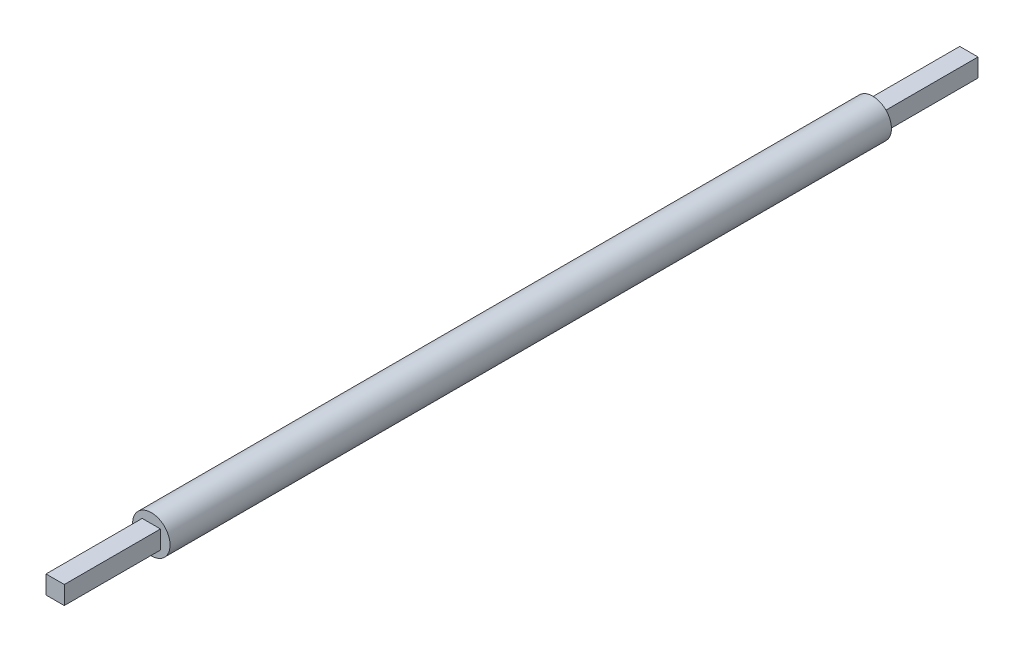
ISO-10303-21;
HEADER;
FILE_DESCRIPTION(('STEP AP214'),'2;1');
FILE_NAME('part.step','',(''),(''),'','','');
FILE_SCHEMA(('AUTOMOTIVE_DESIGN { 1 0 10303 214 1 1 1 1 }'));
ENDSEC;
DATA;
#1=APPLICATION_CONTEXT('core data for automotive mechanical design processes');
#2=APPLICATION_PROTOCOL_DEFINITION('international standard','automotive_design',2000,#1);
#3=PRODUCT_CONTEXT('',#1,'mechanical');
#4=PRODUCT('Part','Part','',(#3));
#5=PRODUCT_RELATED_PRODUCT_CATEGORY('part','',(#4));
#6=PRODUCT_DEFINITION_FORMATION('','',#4);
#7=PRODUCT_DEFINITION_CONTEXT('part definition',#1,'design');
#8=PRODUCT_DEFINITION('design','',#6,#7);
#9=PRODUCT_DEFINITION_SHAPE('','',#8);
#10=(LENGTH_UNIT() NAMED_UNIT(*) SI_UNIT(.MILLI.,.METRE.));
#11=(NAMED_UNIT(*) PLANE_ANGLE_UNIT() SI_UNIT($,.RADIAN.));
#12=(NAMED_UNIT(*) SI_UNIT($,.STERADIAN.) SOLID_ANGLE_UNIT());
#13=UNCERTAINTY_MEASURE_WITH_UNIT(LENGTH_MEASURE(1.E-05),#10,'distance_accuracy_value','');
#14=(GEOMETRIC_REPRESENTATION_CONTEXT(3) GLOBAL_UNCERTAINTY_ASSIGNED_CONTEXT((#13)) GLOBAL_UNIT_ASSIGNED_CONTEXT((#10,
#11,#12)) REPRESENTATION_CONTEXT('',''));
#15=CARTESIAN_POINT('',(0.,0.,0.));
#16=DIRECTION('',(0.,0.,1.));
#17=DIRECTION('',(1.,0.,0.));
#18=AXIS2_PLACEMENT_3D('',#15,#16,#17);
#19=CARTESIAN_POINT('',(0.,0.,-18.75));
#20=DIRECTION('',(0.,0.,-1.));
#21=DIRECTION('',(1.,0.,0.));
#22=AXIS2_PLACEMENT_3D('',#19,#20,#21);
#23=PLANE('',#22);
#24=CARTESIAN_POINT('',(0.,0.,-18.75));
#25=DIRECTION('',(0.,0.,1.));
#26=DIRECTION('',(1.,0.,0.));
#27=AXIS2_PLACEMENT_3D('',#24,#25,#26);
#28=CIRCLE('',#27,0.975);
#29=CARTESIAN_POINT('',(0.975,0.,-18.75));
#30=VERTEX_POINT('',#29);
#31=EDGE_CURVE('E112',#30,#30,#28,.T.);
#32=ORIENTED_EDGE('',*,*,#31,.F.);
#33=EDGE_LOOP('',(#32));
#34=FACE_BOUND('',#33,.T.);
#35=DIRECTION('',(-1.,0.,0.));
#36=VECTOR('',#35,1.);
#37=CARTESIAN_POINT('',(-0.475,0.475,-18.75));
#38=LINE('',#37,#36);
#39=CARTESIAN_POINT('',(0.475,0.475,-18.75));
#40=VERTEX_POINT('',#39);
#41=CARTESIAN_POINT('',(-0.475,0.475,-18.75));
#42=VERTEX_POINT('',#41);
#43=EDGE_CURVE('E133',#40,#42,#38,.T.);
#44=ORIENTED_EDGE('',*,*,#43,.T.);
#45=DIRECTION('',(0.,-1.,0.));
#46=VECTOR('',#45,1.);
#47=CARTESIAN_POINT('',(-0.475,0.475,-18.75));
#48=LINE('',#47,#46);
#49=CARTESIAN_POINT('',(-0.475,-0.475,-18.75));
#50=VERTEX_POINT('',#49);
#51=EDGE_CURVE('E55',#42,#50,#48,.T.);
#52=ORIENTED_EDGE('',*,*,#51,.T.);
#53=DIRECTION('',(1.,0.,0.));
#54=VECTOR('',#53,1.);
#55=CARTESIAN_POINT('',(-0.475,-0.475,-18.75));
#56=LINE('',#55,#54);
#57=CARTESIAN_POINT('',(0.475,-0.475,-18.75));
#58=VERTEX_POINT('',#57);
#59=EDGE_CURVE('E123',#50,#58,#56,.T.);
#60=ORIENTED_EDGE('',*,*,#59,.T.);
#61=DIRECTION('',(0.,1.,0.));
#62=VECTOR('',#61,1.);
#63=CARTESIAN_POINT('',(0.475,0.475,-18.75));
#64=LINE('',#63,#62);
#65=EDGE_CURVE('E135',#58,#40,#64,.T.);
#66=ORIENTED_EDGE('',*,*,#65,.T.);
#67=EDGE_LOOP('',(#44,#52,#60,#66));
#68=FACE_BOUND('',#67,.T.);
#69=ADVANCED_FACE('F40',(#34,#68),#23,.T.);
#70=CARTESIAN_POINT('',(0.,0.,18.75));
#71=DIRECTION('',(0.,0.,-1.));
#72=DIRECTION('',(-1.,0.,0.));
#73=AXIS2_PLACEMENT_3D('',#70,#71,#72);
#74=CYLINDRICAL_SURFACE('',#73,0.975);
#75=CARTESIAN_POINT('',(0.,0.,18.75));
#76=DIRECTION('',(0.,0.,1.));
#77=DIRECTION('',(1.,0.,0.));
#78=AXIS2_PLACEMENT_3D('',#75,#76,#77);
#79=CIRCLE('',#78,0.975);
#80=CARTESIAN_POINT('',(0.975,0.,18.75));
#81=VERTEX_POINT('',#80);
#82=EDGE_CURVE('E11',#81,#81,#79,.T.);
#83=ORIENTED_EDGE('',*,*,#82,.F.);
#84=EDGE_LOOP('',(#83));
#85=FACE_BOUND('',#84,.T.);
#86=ORIENTED_EDGE('',*,*,#31,.T.);
#87=EDGE_LOOP('',(#86));
#88=FACE_BOUND('',#87,.T.);
#89=ADVANCED_FACE('F42',(#85,#88),#74,.T.);
#90=CARTESIAN_POINT('',(0.,0.,18.75));
#91=DIRECTION('',(0.,0.,1.));
#92=DIRECTION('',(1.,0.,0.));
#93=AXIS2_PLACEMENT_3D('',#90,#91,#92);
#94=PLANE('',#93);
#95=DIRECTION('',(0.,-1.,0.));
#96=VECTOR('',#95,1.);
#97=CARTESIAN_POINT('',(-0.475,0.475,18.75));
#98=LINE('',#97,#96);
#99=CARTESIAN_POINT('',(-0.475,0.475,18.75));
#100=VERTEX_POINT('',#99);
#101=CARTESIAN_POINT('',(-0.475,-0.475,18.75));
#102=VERTEX_POINT('',#101);
#103=EDGE_CURVE('E63',#100,#102,#98,.T.);
#104=ORIENTED_EDGE('',*,*,#103,.F.);
#105=DIRECTION('',(-1.,0.,0.));
#106=VECTOR('',#105,1.);
#107=CARTESIAN_POINT('',(-0.475,0.475,18.75));
#108=LINE('',#107,#106);
#109=CARTESIAN_POINT('',(0.475,0.475,18.75));
#110=VERTEX_POINT('',#109);
#111=EDGE_CURVE('E150',#110,#100,#108,.T.);
#112=ORIENTED_EDGE('',*,*,#111,.F.);
#113=DIRECTION('',(0.,1.,0.));
#114=VECTOR('',#113,1.);
#115=CARTESIAN_POINT('',(0.475,0.475,18.75));
#116=LINE('',#115,#114);
#117=CARTESIAN_POINT('',(0.475,-0.475,18.75));
#118=VERTEX_POINT('',#117);
#119=EDGE_CURVE('E161',#118,#110,#116,.T.);
#120=ORIENTED_EDGE('',*,*,#119,.F.);
#121=DIRECTION('',(1.,0.,0.));
#122=VECTOR('',#121,1.);
#123=CARTESIAN_POINT('',(-0.475,-0.475,18.75));
#124=LINE('',#123,#122);
#125=EDGE_CURVE('E158',#102,#118,#124,.T.);
#126=ORIENTED_EDGE('',*,*,#125,.F.);
#127=EDGE_LOOP('',(#104,#112,#120,#126));
#128=FACE_BOUND('',#127,.T.);
#129=ORIENTED_EDGE('',*,*,#82,.T.);
#130=EDGE_LOOP('',(#129));
#131=FACE_BOUND('',#130,.T.);
#132=ADVANCED_FACE('F185',(#128,#131),#94,.T.);
#133=CARTESIAN_POINT('',(-0.475,0.475,23.75));
#134=DIRECTION('',(1.,0.,0.));
#135=DIRECTION('',(0.,1.,0.));
#136=AXIS2_PLACEMENT_3D('',#133,#134,#135);
#137=PLANE('',#136);
#138=ORIENTED_EDGE('',*,*,#103,.T.);
#139=DIRECTION('',(0.,0.,-1.));
#140=VECTOR('',#139,1.);
#141=CARTESIAN_POINT('',(-0.475,-0.475,23.75));
#142=LINE('',#141,#140);
#143=CARTESIAN_POINT('',(-0.475,-0.475,23.75));
#144=VERTEX_POINT('',#143);
#145=EDGE_CURVE('E48',#144,#102,#142,.T.);
#146=ORIENTED_EDGE('',*,*,#145,.F.);
#147=DIRECTION('',(0.,-1.,0.));
#148=VECTOR('',#147,1.);
#149=CARTESIAN_POINT('',(-0.475,0.475,23.75));
#150=LINE('',#149,#148);
#151=CARTESIAN_POINT('',(-0.475,0.475,23.75));
#152=VERTEX_POINT('',#151);
#153=EDGE_CURVE('E146',#152,#144,#150,.T.);
#154=ORIENTED_EDGE('',*,*,#153,.F.);
#155=DIRECTION('',(0.,0.,-1.));
#156=VECTOR('',#155,1.);
#157=CARTESIAN_POINT('',(-0.475,0.475,23.75));
#158=LINE('',#157,#156);
#159=EDGE_CURVE('E156',#152,#100,#158,.T.);
#160=ORIENTED_EDGE('',*,*,#159,.T.);
#161=EDGE_LOOP('',(#138,#146,#154,#160));
#162=FACE_BOUND('',#161,.T.);
#163=ADVANCED_FACE('F179',(#162),#137,.F.);
#164=CARTESIAN_POINT('',(-0.475,-0.475,23.75));
#165=DIRECTION('',(0.,1.,0.));
#166=DIRECTION('',(0.,0.,1.));
#167=AXIS2_PLACEMENT_3D('',#164,#165,#166);
#168=PLANE('',#167);
#169=ORIENTED_EDGE('',*,*,#125,.T.);
#170=DIRECTION('',(0.,0.,-1.));
#171=VECTOR('',#170,1.);
#172=CARTESIAN_POINT('',(0.475,-0.475,23.75));
#173=LINE('',#172,#171);
#174=CARTESIAN_POINT('',(0.475,-0.475,23.75));
#175=VERTEX_POINT('',#174);
#176=EDGE_CURVE('E170',#175,#118,#173,.T.);
#177=ORIENTED_EDGE('',*,*,#176,.F.);
#178=DIRECTION('',(1.,0.,0.));
#179=VECTOR('',#178,1.);
#180=CARTESIAN_POINT('',(-0.475,-0.475,23.75));
#181=LINE('',#180,#179);
#182=EDGE_CURVE('E149',#144,#175,#181,.T.);
#183=ORIENTED_EDGE('',*,*,#182,.F.);
#184=ORIENTED_EDGE('',*,*,#145,.T.);
#185=EDGE_LOOP('',(#169,#177,#183,#184));
#186=FACE_BOUND('',#185,.T.);
#187=ADVANCED_FACE('F175',(#186),#168,.F.);
#188=CARTESIAN_POINT('',(0.475,0.475,23.75));
#189=DIRECTION('',(-1.,0.,0.));
#190=DIRECTION('',(0.,-1.,0.));
#191=AXIS2_PLACEMENT_3D('',#188,#189,#190);
#192=PLANE('',#191);
#193=ORIENTED_EDGE('',*,*,#119,.T.);
#194=DIRECTION('',(0.,0.,-1.));
#195=VECTOR('',#194,1.);
#196=CARTESIAN_POINT('',(0.475,0.475,23.75));
#197=LINE('',#196,#195);
#198=CARTESIAN_POINT('',(0.475,0.475,23.75));
#199=VERTEX_POINT('',#198);
#200=EDGE_CURVE('E167',#199,#110,#197,.T.);
#201=ORIENTED_EDGE('',*,*,#200,.F.);
#202=DIRECTION('',(0.,1.,0.));
#203=VECTOR('',#202,1.);
#204=CARTESIAN_POINT('',(0.475,0.475,23.75));
#205=LINE('',#204,#203);
#206=EDGE_CURVE('E152',#175,#199,#205,.T.);
#207=ORIENTED_EDGE('',*,*,#206,.F.);
#208=ORIENTED_EDGE('',*,*,#176,.T.);
#209=EDGE_LOOP('',(#193,#201,#207,#208));
#210=FACE_BOUND('',#209,.T.);
#211=ADVANCED_FACE('F188',(#210),#192,.F.);
#212=CARTESIAN_POINT('',(-0.475,0.475,23.75));
#213=DIRECTION('',(0.,-1.,0.));
#214=DIRECTION('',(0.,0.,-1.));
#215=AXIS2_PLACEMENT_3D('',#212,#213,#214);
#216=PLANE('',#215);
#217=ORIENTED_EDGE('',*,*,#111,.T.);
#218=ORIENTED_EDGE('',*,*,#159,.F.);
#219=DIRECTION('',(-1.,0.,0.));
#220=VECTOR('',#219,1.);
#221=CARTESIAN_POINT('',(-0.475,0.475,23.75));
#222=LINE('',#221,#220);
#223=EDGE_CURVE('E154',#199,#152,#222,.T.);
#224=ORIENTED_EDGE('',*,*,#223,.F.);
#225=ORIENTED_EDGE('',*,*,#200,.T.);
#226=EDGE_LOOP('',(#217,#218,#224,#225));
#227=FACE_BOUND('',#226,.T.);
#228=ADVANCED_FACE('F183',(#227),#216,.F.);
#229=CARTESIAN_POINT('',(0.,0.,23.75));
#230=DIRECTION('',(0.,0.,1.));
#231=DIRECTION('',(1.,0.,0.));
#232=AXIS2_PLACEMENT_3D('',#229,#230,#231);
#233=PLANE('',#232);
#234=ORIENTED_EDGE('',*,*,#153,.T.);
#235=ORIENTED_EDGE('',*,*,#182,.T.);
#236=ORIENTED_EDGE('',*,*,#206,.T.);
#237=ORIENTED_EDGE('',*,*,#223,.T.);
#238=EDGE_LOOP('',(#234,#235,#236,#237));
#239=FACE_BOUND('',#238,.T.);
#240=ADVANCED_FACE('F191',(#239),#233,.T.);
#241=CARTESIAN_POINT('',(-0.475,0.475,-23.75));
#242=DIRECTION('',(-1.,0.,0.));
#243=DIRECTION('',(0.,-1.,0.));
#244=AXIS2_PLACEMENT_3D('',#241,#242,#243);
#245=PLANE('',#244);
#246=ORIENTED_EDGE('',*,*,#51,.F.);
#247=DIRECTION('',(0.,0.,1.));
#248=VECTOR('',#247,1.);
#249=CARTESIAN_POINT('',(-0.475,0.475,-23.75));
#250=LINE('',#249,#248);
#251=CARTESIAN_POINT('',(-0.475,0.475,-23.75));
#252=VERTEX_POINT('',#251);
#253=EDGE_CURVE('E103',#252,#42,#250,.T.);
#254=ORIENTED_EDGE('',*,*,#253,.F.);
#255=DIRECTION('',(0.,-1.,0.));
#256=VECTOR('',#255,1.);
#257=CARTESIAN_POINT('',(-0.475,0.475,-23.75));
#258=LINE('',#257,#256);
#259=CARTESIAN_POINT('',(-0.475,-0.475,-23.75));
#260=VERTEX_POINT('',#259);
#261=EDGE_CURVE('E106',#252,#260,#258,.T.);
#262=ORIENTED_EDGE('',*,*,#261,.T.);
#263=DIRECTION('',(0.,0.,1.));
#264=VECTOR('',#263,1.);
#265=CARTESIAN_POINT('',(-0.475,-0.475,-23.75));
#266=LINE('',#265,#264);
#267=EDGE_CURVE('E131',#260,#50,#266,.T.);
#268=ORIENTED_EDGE('',*,*,#267,.T.);
#269=EDGE_LOOP('',(#246,#254,#262,#268));
#270=FACE_BOUND('',#269,.T.);
#271=ADVANCED_FACE('F105',(#270),#245,.T.);
#272=CARTESIAN_POINT('',(-0.475,0.475,-23.75));
#273=DIRECTION('',(0.,1.,0.));
#274=DIRECTION('',(0.,0.,1.));
#275=AXIS2_PLACEMENT_3D('',#272,#273,#274);
#276=PLANE('',#275);
#277=ORIENTED_EDGE('',*,*,#43,.F.);
#278=DIRECTION('',(0.,0.,1.));
#279=VECTOR('',#278,1.);
#280=CARTESIAN_POINT('',(0.475,0.475,-23.75));
#281=LINE('',#280,#279);
#282=CARTESIAN_POINT('',(0.475,0.475,-23.75));
#283=VERTEX_POINT('',#282);
#284=EDGE_CURVE('E113',#283,#40,#281,.T.);
#285=ORIENTED_EDGE('',*,*,#284,.F.);
#286=DIRECTION('',(-1.,0.,0.));
#287=VECTOR('',#286,1.);
#288=CARTESIAN_POINT('',(-0.475,0.475,-23.75));
#289=LINE('',#288,#287);
#290=EDGE_CURVE('E119',#283,#252,#289,.T.);
#291=ORIENTED_EDGE('',*,*,#290,.T.);
#292=ORIENTED_EDGE('',*,*,#253,.T.);
#293=EDGE_LOOP('',(#277,#285,#291,#292));
#294=FACE_BOUND('',#293,.T.);
#295=ADVANCED_FACE('F125',(#294),#276,.T.);
#296=CARTESIAN_POINT('',(0.475,0.475,-23.75));
#297=DIRECTION('',(1.,0.,0.));
#298=DIRECTION('',(0.,1.,0.));
#299=AXIS2_PLACEMENT_3D('',#296,#297,#298);
#300=PLANE('',#299);
#301=ORIENTED_EDGE('',*,*,#65,.F.);
#302=DIRECTION('',(0.,0.,1.));
#303=VECTOR('',#302,1.);
#304=CARTESIAN_POINT('',(0.475,-0.475,-23.75));
#305=LINE('',#304,#303);
#306=CARTESIAN_POINT('',(0.475,-0.475,-23.75));
#307=VERTEX_POINT('',#306);
#308=EDGE_CURVE('E141',#307,#58,#305,.T.);
#309=ORIENTED_EDGE('',*,*,#308,.F.);
#310=DIRECTION('',(0.,1.,0.));
#311=VECTOR('',#310,1.);
#312=CARTESIAN_POINT('',(0.475,0.475,-23.75));
#313=LINE('',#312,#311);
#314=EDGE_CURVE('E126',#307,#283,#313,.T.);
#315=ORIENTED_EDGE('',*,*,#314,.T.);
#316=ORIENTED_EDGE('',*,*,#284,.T.);
#317=EDGE_LOOP('',(#301,#309,#315,#316));
#318=FACE_BOUND('',#317,.T.);
#319=ADVANCED_FACE('F212',(#318),#300,.T.);
#320=CARTESIAN_POINT('',(-0.475,-0.475,-23.75));
#321=DIRECTION('',(0.,-1.,0.));
#322=DIRECTION('',(0.,0.,-1.));
#323=AXIS2_PLACEMENT_3D('',#320,#321,#322);
#324=PLANE('',#323);
#325=ORIENTED_EDGE('',*,*,#59,.F.);
#326=ORIENTED_EDGE('',*,*,#267,.F.);
#327=DIRECTION('',(1.,0.,0.));
#328=VECTOR('',#327,1.);
#329=CARTESIAN_POINT('',(-0.475,-0.475,-23.75));
#330=LINE('',#329,#328);
#331=EDGE_CURVE('E122',#260,#307,#330,.T.);
#332=ORIENTED_EDGE('',*,*,#331,.T.);
#333=ORIENTED_EDGE('',*,*,#308,.T.);
#334=EDGE_LOOP('',(#325,#326,#332,#333));
#335=FACE_BOUND('',#334,.T.);
#336=ADVANCED_FACE('F215',(#335),#324,.T.);
#337=CARTESIAN_POINT('',(0.,0.,-23.75));
#338=DIRECTION('',(0.,0.,-1.));
#339=DIRECTION('',(1.,0.,0.));
#340=AXIS2_PLACEMENT_3D('',#337,#338,#339);
#341=PLANE('',#340);
#342=ORIENTED_EDGE('',*,*,#261,.F.);
#343=ORIENTED_EDGE('',*,*,#290,.F.);
#344=ORIENTED_EDGE('',*,*,#314,.F.);
#345=ORIENTED_EDGE('',*,*,#331,.F.);
#346=EDGE_LOOP('',(#342,#343,#344,#345));
#347=FACE_BOUND('',#346,.T.);
#348=ADVANCED_FACE('F117',(#347),#341,.T.);
#349=CLOSED_SHELL('',(#69,#89,#132,#163,#187,#211,#228,#240,#271,#295,#319,#336,#348));
#350=MANIFOLD_SOLID_BREP('B2',#349);
#351=ADVANCED_BREP_SHAPE_REPRESENTATION('',(#18,#350),#14);
#352=SHAPE_DEFINITION_REPRESENTATION(#9,#351);
ENDSEC;
END-ISO-10303-21;
